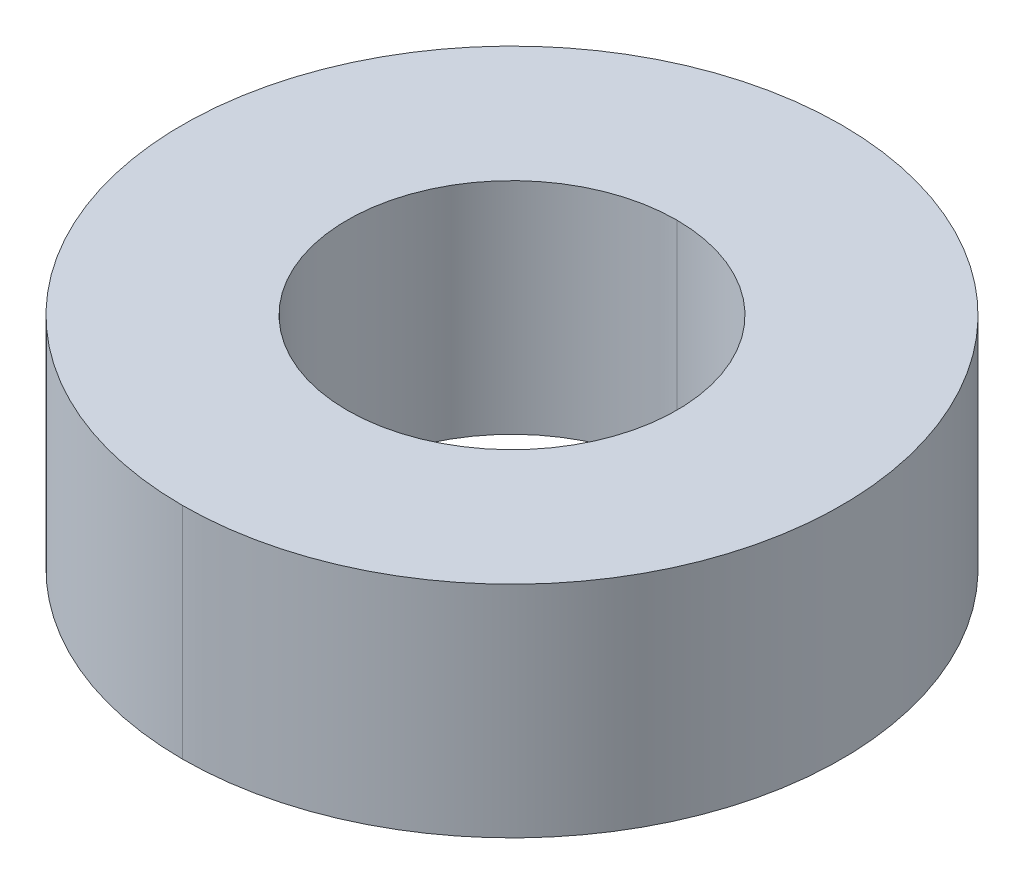
ISO-10303-21;
HEADER;
FILE_DESCRIPTION(('STEP AP214'),'2;1');
FILE_NAME('part.step','',(''),(''),'','','');
FILE_SCHEMA(('AUTOMOTIVE_DESIGN { 1 0 10303 214 1 1 1 1 }'));
ENDSEC;
DATA;
#1=APPLICATION_CONTEXT('core data for automotive mechanical design processes');
#2=APPLICATION_PROTOCOL_DEFINITION('international standard','automotive_design',2000,#1);
#3=PRODUCT_CONTEXT('',#1,'mechanical');
#4=PRODUCT('Part','Part','',(#3));
#5=PRODUCT_RELATED_PRODUCT_CATEGORY('part','',(#4));
#6=PRODUCT_DEFINITION_FORMATION('','',#4);
#7=PRODUCT_DEFINITION_CONTEXT('part definition',#1,'design');
#8=PRODUCT_DEFINITION('design','',#6,#7);
#9=PRODUCT_DEFINITION_SHAPE('','',#8);
#10=(LENGTH_UNIT() NAMED_UNIT(*) SI_UNIT(.MILLI.,.METRE.));
#11=(NAMED_UNIT(*) PLANE_ANGLE_UNIT() SI_UNIT($,.RADIAN.));
#12=(NAMED_UNIT(*) SI_UNIT($,.STERADIAN.) SOLID_ANGLE_UNIT());
#13=UNCERTAINTY_MEASURE_WITH_UNIT(LENGTH_MEASURE(1.E-05),#10,'distance_accuracy_value','');
#14=(GEOMETRIC_REPRESENTATION_CONTEXT(3) GLOBAL_UNCERTAINTY_ASSIGNED_CONTEXT((#13)) GLOBAL_UNIT_ASSIGNED_CONTEXT((#10,
#11,#12)) REPRESENTATION_CONTEXT('',''));
#15=CARTESIAN_POINT('',(0.,0.,0.));
#16=DIRECTION('',(0.,0.,1.));
#17=DIRECTION('',(1.,0.,0.));
#18=AXIS2_PLACEMENT_3D('',#15,#16,#17);
#19=CARTESIAN_POINT('',(0.,2.,0.));
#20=DIRECTION('',(0.,-1.,0.));
#21=DIRECTION('',(0.,0.,-1.));
#22=AXIS2_PLACEMENT_3D('',#19,#20,#21);
#23=CYLINDRICAL_SURFACE('',#22,1.5);
#24=DIRECTION('',(0.,-1.,0.));
#25=VECTOR('',#24,1.);
#26=CARTESIAN_POINT('',(0.,2.,1.5));
#27=LINE('',#26,#25);
#28=CARTESIAN_POINT('',(0.,2.,1.5));
#29=VERTEX_POINT('',#28);
#30=CARTESIAN_POINT('',(0.,0.,1.5));
#31=VERTEX_POINT('',#30);
#32=EDGE_CURVE('E107',#29,#31,#27,.T.);
#33=ORIENTED_EDGE('',*,*,#32,.F.);
#34=CARTESIAN_POINT('',(0.,2.,0.));
#35=DIRECTION('',(0.,1.,0.));
#36=DIRECTION('',(0.,0.,1.));
#37=AXIS2_PLACEMENT_3D('',#34,#35,#36);
#38=CIRCLE('',#37,1.5);
#39=CARTESIAN_POINT('',(0.,2.,-1.5));
#40=VERTEX_POINT('',#39);
#41=EDGE_CURVE('E64',#29,#40,#38,.T.);
#42=ORIENTED_EDGE('',*,*,#41,.T.);
#43=DIRECTION('',(0.,-1.,0.));
#44=VECTOR('',#43,1.);
#45=CARTESIAN_POINT('',(0.,2.,-1.5));
#46=LINE('',#45,#44);
#47=CARTESIAN_POINT('',(0.,0.,-1.5));
#48=VERTEX_POINT('',#47);
#49=EDGE_CURVE('E74',#40,#48,#46,.T.);
#50=ORIENTED_EDGE('',*,*,#49,.T.);
#51=CARTESIAN_POINT('',(0.,0.,0.));
#52=DIRECTION('',(0.,1.,0.));
#53=DIRECTION('',(0.,0.,1.));
#54=AXIS2_PLACEMENT_3D('',#51,#52,#53);
#55=CIRCLE('',#54,1.5);
#56=EDGE_CURVE('E10',#31,#48,#55,.T.);
#57=ORIENTED_EDGE('',*,*,#56,.F.);
#58=EDGE_LOOP('',(#33,#42,#50,#57));
#59=FACE_BOUND('',#58,.T.);
#60=ADVANCED_FACE('F16',(#59),#23,.F.);
#61=CARTESIAN_POINT('',(0.,2.,0.));
#62=DIRECTION('',(0.,-1.,0.));
#63=DIRECTION('',(0.,0.,-1.));
#64=AXIS2_PLACEMENT_3D('',#61,#62,#63);
#65=CYLINDRICAL_SURFACE('',#64,3.);
#66=DIRECTION('',(0.,-1.,0.));
#67=VECTOR('',#66,1.);
#68=CARTESIAN_POINT('',(0.,2.,3.));
#69=LINE('',#68,#67);
#70=CARTESIAN_POINT('',(0.,2.,3.));
#71=VERTEX_POINT('',#70);
#72=CARTESIAN_POINT('',(0.,0.,3.));
#73=VERTEX_POINT('',#72);
#74=EDGE_CURVE('E59',#71,#73,#69,.T.);
#75=ORIENTED_EDGE('',*,*,#74,.F.);
#76=CARTESIAN_POINT('',(0.,2.,0.));
#77=DIRECTION('',(0.,1.,0.));
#78=DIRECTION('',(0.,0.,1.));
#79=AXIS2_PLACEMENT_3D('',#76,#77,#78);
#80=CIRCLE('',#79,3.);
#81=CARTESIAN_POINT('',(0.,2.,-3.));
#82=VERTEX_POINT('',#81);
#83=EDGE_CURVE('E53',#82,#71,#80,.T.);
#84=ORIENTED_EDGE('',*,*,#83,.F.);
#85=DIRECTION('',(0.,-1.,0.));
#86=VECTOR('',#85,1.);
#87=CARTESIAN_POINT('',(0.,2.,-3.));
#88=LINE('',#87,#86);
#89=CARTESIAN_POINT('',(0.,0.,-3.));
#90=VERTEX_POINT('',#89);
#91=EDGE_CURVE('E56',#82,#90,#88,.T.);
#92=ORIENTED_EDGE('',*,*,#91,.T.);
#93=CARTESIAN_POINT('',(0.,0.,0.));
#94=DIRECTION('',(0.,1.,0.));
#95=DIRECTION('',(0.,0.,1.));
#96=AXIS2_PLACEMENT_3D('',#93,#94,#95);
#97=CIRCLE('',#96,3.);
#98=EDGE_CURVE('E19',#90,#73,#97,.T.);
#99=ORIENTED_EDGE('',*,*,#98,.T.);
#100=EDGE_LOOP('',(#75,#84,#92,#99));
#101=FACE_BOUND('',#100,.T.);
#102=ADVANCED_FACE('F55',(#101),#65,.T.);
#103=CARTESIAN_POINT('',(0.,0.,0.));
#104=DIRECTION('',(0.,1.,0.));
#105=DIRECTION('',(1.,0.,0.));
#106=AXIS2_PLACEMENT_3D('',#103,#104,#105);
#107=PLANE('',#106);
#108=CARTESIAN_POINT('',(0.,0.,0.));
#109=DIRECTION('',(0.,1.,0.));
#110=DIRECTION('',(0.,0.,1.));
#111=AXIS2_PLACEMENT_3D('',#108,#109,#110);
#112=CIRCLE('',#111,1.5);
#113=EDGE_CURVE('E82',#48,#31,#112,.T.);
#114=ORIENTED_EDGE('',*,*,#113,.T.);
#115=ORIENTED_EDGE('',*,*,#56,.T.);
#116=EDGE_LOOP('',(#114,#115));
#117=FACE_BOUND('',#116,.T.);
#118=ORIENTED_EDGE('',*,*,#98,.F.);
#119=CARTESIAN_POINT('',(0.,0.,0.));
#120=DIRECTION('',(0.,1.,0.));
#121=DIRECTION('',(0.,0.,1.));
#122=AXIS2_PLACEMENT_3D('',#119,#120,#121);
#123=CIRCLE('',#122,3.);
#124=EDGE_CURVE('E69',#73,#90,#123,.T.);
#125=ORIENTED_EDGE('',*,*,#124,.F.);
#126=EDGE_LOOP('',(#118,#125));
#127=FACE_BOUND('',#126,.T.);
#128=ADVANCED_FACE('F98',(#117,#127),#107,.F.);
#129=CARTESIAN_POINT('',(0.,2.,0.));
#130=DIRECTION('',(0.,1.,0.));
#131=DIRECTION('',(1.,0.,0.));
#132=AXIS2_PLACEMENT_3D('',#129,#130,#131);
#133=PLANE('',#132);
#134=CARTESIAN_POINT('',(0.,2.,0.));
#135=DIRECTION('',(0.,1.,0.));
#136=DIRECTION('',(0.,0.,1.));
#137=AXIS2_PLACEMENT_3D('',#134,#135,#136);
#138=CIRCLE('',#137,1.5);
#139=EDGE_CURVE('E105',#40,#29,#138,.T.);
#140=ORIENTED_EDGE('',*,*,#139,.F.);
#141=ORIENTED_EDGE('',*,*,#41,.F.);
#142=EDGE_LOOP('',(#140,#141));
#143=FACE_BOUND('',#142,.T.);
#144=ORIENTED_EDGE('',*,*,#83,.T.);
#145=CARTESIAN_POINT('',(0.,2.,0.));
#146=DIRECTION('',(0.,1.,0.));
#147=DIRECTION('',(0.,0.,1.));
#148=AXIS2_PLACEMENT_3D('',#145,#146,#147);
#149=CIRCLE('',#148,3.);
#150=EDGE_CURVE('E68',#71,#82,#149,.T.);
#151=ORIENTED_EDGE('',*,*,#150,.T.);
#152=EDGE_LOOP('',(#144,#151));
#153=FACE_BOUND('',#152,.T.);
#154=ADVANCED_FACE('F72',(#143,#153),#133,.T.);
#155=CARTESIAN_POINT('',(0.,2.,0.));
#156=DIRECTION('',(0.,-1.,0.));
#157=DIRECTION('',(0.,0.,-1.));
#158=AXIS2_PLACEMENT_3D('',#155,#156,#157);
#159=CYLINDRICAL_SURFACE('',#158,3.);
#160=ORIENTED_EDGE('',*,*,#150,.F.);
#161=ORIENTED_EDGE('',*,*,#74,.T.);
#162=ORIENTED_EDGE('',*,*,#124,.T.);
#163=ORIENTED_EDGE('',*,*,#91,.F.);
#164=EDGE_LOOP('',(#160,#161,#162,#163));
#165=FACE_BOUND('',#164,.T.);
#166=ADVANCED_FACE('F67',(#165),#159,.T.);
#167=CARTESIAN_POINT('',(0.,2.,0.));
#168=DIRECTION('',(0.,-1.,0.));
#169=DIRECTION('',(0.,0.,-1.));
#170=AXIS2_PLACEMENT_3D('',#167,#168,#169);
#171=CYLINDRICAL_SURFACE('',#170,1.5);
#172=ORIENTED_EDGE('',*,*,#139,.T.);
#173=ORIENTED_EDGE('',*,*,#32,.T.);
#174=ORIENTED_EDGE('',*,*,#113,.F.);
#175=ORIENTED_EDGE('',*,*,#49,.F.);
#176=EDGE_LOOP('',(#172,#173,#174,#175));
#177=FACE_BOUND('',#176,.T.);
#178=ADVANCED_FACE('F122',(#177),#171,.F.);
#179=CLOSED_SHELL('',(#60,#102,#128,#154,#166,#178));
#180=MANIFOLD_SOLID_BREP('B1',#179);
#181=ADVANCED_BREP_SHAPE_REPRESENTATION('',(#18,#180),#14);
#182=SHAPE_DEFINITION_REPRESENTATION(#9,#181);
ENDSEC;
END-ISO-10303-21;
